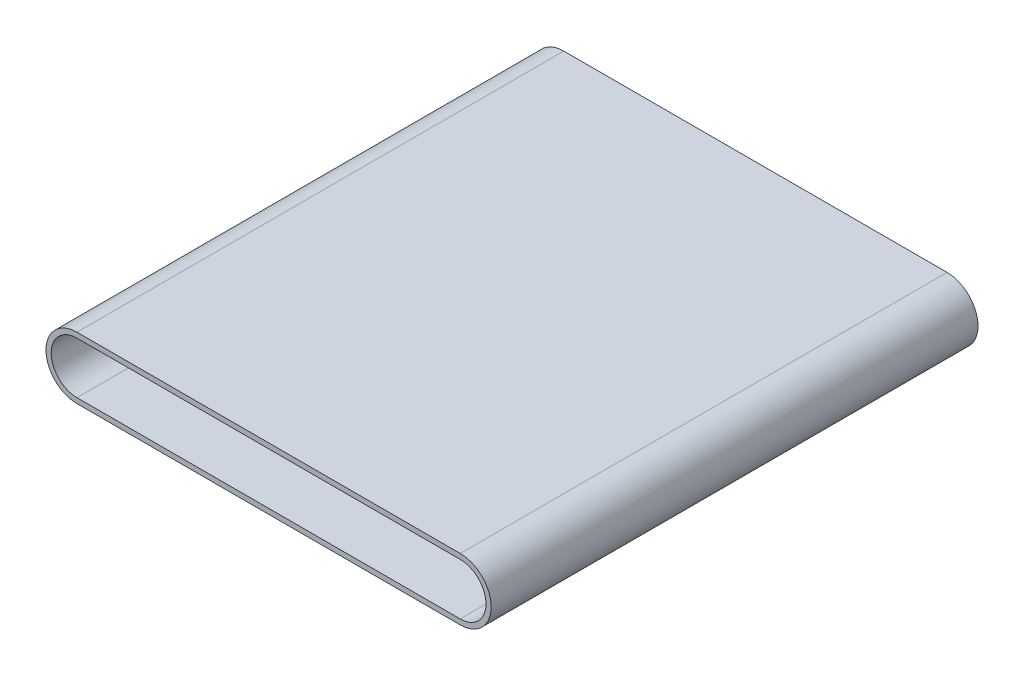
ISO-10303-21;
HEADER;
FILE_DESCRIPTION(('STEP AP214'),'2;1');
FILE_NAME('part.step','',(''),(''),'','','');
FILE_SCHEMA(('AUTOMOTIVE_DESIGN { 1 0 10303 214 1 1 1 1 }'));
ENDSEC;
DATA;
#1=APPLICATION_CONTEXT('core data for automotive mechanical design processes');
#2=APPLICATION_PROTOCOL_DEFINITION('international standard','automotive_design',2000,#1);
#3=PRODUCT_CONTEXT('',#1,'mechanical');
#4=PRODUCT('Part','Part','',(#3));
#5=PRODUCT_RELATED_PRODUCT_CATEGORY('part','',(#4));
#6=PRODUCT_DEFINITION_FORMATION('','',#4);
#7=PRODUCT_DEFINITION_CONTEXT('part definition',#1,'design');
#8=PRODUCT_DEFINITION('design','',#6,#7);
#9=PRODUCT_DEFINITION_SHAPE('','',#8);
#10=(LENGTH_UNIT() NAMED_UNIT(*) SI_UNIT(.MILLI.,.METRE.));
#11=(NAMED_UNIT(*) PLANE_ANGLE_UNIT() SI_UNIT($,.RADIAN.));
#12=(NAMED_UNIT(*) SI_UNIT($,.STERADIAN.) SOLID_ANGLE_UNIT());
#13=UNCERTAINTY_MEASURE_WITH_UNIT(LENGTH_MEASURE(1.E-05),#10,'distance_accuracy_value','');
#14=(GEOMETRIC_REPRESENTATION_CONTEXT(3) GLOBAL_UNCERTAINTY_ASSIGNED_CONTEXT((#13)) GLOBAL_UNIT_ASSIGNED_CONTEXT((#10,
#11,#12)) REPRESENTATION_CONTEXT('',''));
#15=CARTESIAN_POINT('',(0.,0.,0.));
#16=DIRECTION('',(0.,0.,1.));
#17=DIRECTION('',(1.,0.,0.));
#18=AXIS2_PLACEMENT_3D('',#15,#16,#17);
#19=CARTESIAN_POINT('',(-370.,24.8750000000001,235.));
#20=DIRECTION('',(0.,-1.,0.));
#21=DIRECTION('',(0.,0.,-1.));
#22=AXIS2_PLACEMENT_3D('',#19,#20,#21);
#23=PLANE('',#22);
#24=DIRECTION('',(0.,0.,-1.));
#25=VECTOR('',#24,1.);
#26=CARTESIAN_POINT('',(-370.,24.8750000000001,235.));
#27=LINE('',#26,#25);
#28=CARTESIAN_POINT('',(-370.,24.8750000000001,235.));
#29=VERTEX_POINT('',#28);
#30=CARTESIAN_POINT('',(-370.,24.8750000000001,-235.));
#31=VERTEX_POINT('',#30);
#32=EDGE_CURVE('E124',#29,#31,#27,.T.);
#33=ORIENTED_EDGE('',*,*,#32,.T.);
#34=DIRECTION('',(1.,0.,0.));
#35=VECTOR('',#34,1.);
#36=CARTESIAN_POINT('',(-370.,24.8750000000001,-235.));
#37=LINE('',#36,#35);
#38=CARTESIAN_POINT('',(0.,24.8750000000001,-235.));
#39=VERTEX_POINT('',#38);
#40=EDGE_CURVE('E46',#31,#39,#37,.T.);
#41=ORIENTED_EDGE('',*,*,#40,.T.);
#42=CARTESIAN_POINT('',(0.,24.8750000000001,235.));
#43=DIRECTION('',(0.,0.,-1.));
#44=VECTOR('',#43,1.);
#45=LINE('',#42,#44);
#46=CARTESIAN_POINT('',(0.,24.8750000000001,235.));
#47=VERTEX_POINT('',#46);
#48=EDGE_CURVE('E115',#47,#39,#45,.T.);
#49=ORIENTED_EDGE('',*,*,#48,.F.);
#50=DIRECTION('',(1.,0.,0.));
#51=VECTOR('',#50,1.);
#52=CARTESIAN_POINT('',(-370.,24.8750000000001,235.));
#53=LINE('',#52,#51);
#54=EDGE_CURVE('E11',#29,#47,#53,.T.);
#55=ORIENTED_EDGE('',*,*,#54,.F.);
#56=EDGE_LOOP('',(#33,#41,#49,#55));
#57=FACE_BOUND('',#56,.T.);
#58=ADVANCED_FACE('F35',(#57),#23,.T.);
#59=CARTESIAN_POINT('',(-370.,29.8750000000001,235.));
#60=DIRECTION('',(0.,1.,0.));
#61=DIRECTION('',(0.,0.,1.));
#62=AXIS2_PLACEMENT_3D('',#59,#60,#61);
#63=PLANE('',#62);
#64=DIRECTION('',(0.,0.,1.));
#65=VECTOR('',#64,1.);
#66=CARTESIAN_POINT('',(-370.,29.8750000000001,235.));
#67=LINE('',#66,#65);
#68=CARTESIAN_POINT('',(-370.,29.8750000000001,-235.));
#69=VERTEX_POINT('',#68);
#70=CARTESIAN_POINT('',(-370.,29.8750000000001,235.));
#71=VERTEX_POINT('',#70);
#72=EDGE_CURVE('E216',#69,#71,#67,.T.);
#73=ORIENTED_EDGE('',*,*,#72,.T.);
#74=DIRECTION('',(1.,0.,0.));
#75=VECTOR('',#74,1.);
#76=CARTESIAN_POINT('',(-370.,29.8750000000001,235.));
#77=LINE('',#76,#75);
#78=CARTESIAN_POINT('',(0.,29.8750000000001,235.));
#79=VERTEX_POINT('',#78);
#80=EDGE_CURVE('E62',#71,#79,#77,.T.);
#81=ORIENTED_EDGE('',*,*,#80,.T.);
#82=CARTESIAN_POINT('',(0.,29.8750000000001,-235.));
#83=DIRECTION('',(0.,0.,1.));
#84=VECTOR('',#83,1.);
#85=LINE('',#82,#84);
#86=CARTESIAN_POINT('',(0.,29.8750000000001,-235.));
#87=VERTEX_POINT('',#86);
#88=EDGE_CURVE('E120',#87,#79,#85,.T.);
#89=ORIENTED_EDGE('',*,*,#88,.F.);
#90=DIRECTION('',(1.,0.,0.));
#91=VECTOR('',#90,1.);
#92=CARTESIAN_POINT('',(-370.,29.8750000000001,-235.));
#93=LINE('',#92,#91);
#94=EDGE_CURVE('E126',#69,#87,#93,.T.);
#95=ORIENTED_EDGE('',*,*,#94,.F.);
#96=EDGE_LOOP('',(#73,#81,#89,#95));
#97=FACE_BOUND('',#96,.T.);
#98=ADVANCED_FACE('F144',(#97),#63,.T.);
#99=CARTESIAN_POINT('',(-370.,0.,0.));
#100=DIRECTION('',(0.,0.,-1.));
#101=DIRECTION('',(-1.,0.,0.));
#102=AXIS2_PLACEMENT_3D('',#99,#100,#101);
#103=CYLINDRICAL_SURFACE('',#102,24.8750000000001);
#104=DIRECTION('',(0.,0.,-1.));
#105=VECTOR('',#104,1.);
#106=CARTESIAN_POINT('',(-370.,-24.8750000000001,235.));
#107=LINE('',#106,#105);
#108=CARTESIAN_POINT('',(-370.,-24.8750000000001,235.));
#109=VERTEX_POINT('',#108);
#110=CARTESIAN_POINT('',(-370.,-24.8750000000001,-235.));
#111=VERTEX_POINT('',#110);
#112=EDGE_CURVE('E227',#109,#111,#107,.T.);
#113=ORIENTED_EDGE('',*,*,#112,.T.);
#114=CARTESIAN_POINT('',(-370.,0.,-235.));
#115=DIRECTION('',(0.,0.,-1.));
#116=DIRECTION('',(-1.,0.,0.));
#117=AXIS2_PLACEMENT_3D('',#114,#115,#116);
#118=CIRCLE('',#117,24.8750000000001);
#119=EDGE_CURVE('E198',#111,#31,#118,.T.);
#120=ORIENTED_EDGE('',*,*,#119,.T.);
#121=ORIENTED_EDGE('',*,*,#32,.F.);
#122=CARTESIAN_POINT('',(-370.,0.,235.));
#123=DIRECTION('',(0.,0.,-1.));
#124=DIRECTION('',(-1.,0.,0.));
#125=AXIS2_PLACEMENT_3D('',#122,#123,#124);
#126=CIRCLE('',#125,24.8750000000001);
#127=EDGE_CURVE('E196',#109,#29,#126,.T.);
#128=ORIENTED_EDGE('',*,*,#127,.F.);
#129=EDGE_LOOP('',(#113,#120,#121,#128));
#130=FACE_BOUND('',#129,.T.);
#131=ADVANCED_FACE('F153',(#130),#103,.F.);
#132=CARTESIAN_POINT('',(-370.,0.,0.));
#133=DIRECTION('',(0.,0.,-1.));
#134=DIRECTION('',(-1.,0.,0.));
#135=AXIS2_PLACEMENT_3D('',#132,#133,#134);
#136=CYLINDRICAL_SURFACE('',#135,29.8750000000001);
#137=DIRECTION('',(0.,0.,1.));
#138=VECTOR('',#137,1.);
#139=CARTESIAN_POINT('',(-370.,-29.8750000000001,235.));
#140=LINE('',#139,#138);
#141=CARTESIAN_POINT('',(-370.,-29.8750000000001,-235.));
#142=VERTEX_POINT('',#141);
#143=CARTESIAN_POINT('',(-370.,-29.8750000000001,235.));
#144=VERTEX_POINT('',#143);
#145=EDGE_CURVE('E230',#142,#144,#140,.T.);
#146=ORIENTED_EDGE('',*,*,#145,.T.);
#147=CARTESIAN_POINT('',(-370.,0.,235.));
#148=DIRECTION('',(0.,0.,-1.));
#149=DIRECTION('',(-1.,0.,0.));
#150=AXIS2_PLACEMENT_3D('',#147,#148,#149);
#151=CIRCLE('',#150,29.8750000000001);
#152=EDGE_CURVE('E212',#144,#71,#151,.T.);
#153=ORIENTED_EDGE('',*,*,#152,.T.);
#154=ORIENTED_EDGE('',*,*,#72,.F.);
#155=CARTESIAN_POINT('',(-370.,0.,-235.));
#156=DIRECTION('',(0.,0.,-1.));
#157=DIRECTION('',(-1.,0.,0.));
#158=AXIS2_PLACEMENT_3D('',#155,#156,#157);
#159=CIRCLE('',#158,29.8750000000001);
#160=EDGE_CURVE('E202',#142,#69,#159,.T.);
#161=ORIENTED_EDGE('',*,*,#160,.F.);
#162=EDGE_LOOP('',(#146,#153,#154,#161));
#163=FACE_BOUND('',#162,.T.);
#164=ADVANCED_FACE('F156',(#163),#136,.T.);
#165=CARTESIAN_POINT('',(-2.18998296012152E-13,-24.8750000000001,235.));
#166=DIRECTION('',(0.,1.,0.));
#167=DIRECTION('',(0.,0.,1.));
#168=AXIS2_PLACEMENT_3D('',#165,#166,#167);
#169=PLANE('',#168);
#170=DIRECTION('',(0.,0.,-1.));
#171=VECTOR('',#170,1.);
#172=CARTESIAN_POINT('',(-2.18998296012152E-13,-24.8750000000001,235.));
#173=LINE('',#172,#171);
#174=CARTESIAN_POINT('',(-2.18998296012152E-13,-24.8750000000001,235.));
#175=VERTEX_POINT('',#174);
#176=CARTESIAN_POINT('',(-2.18998296012152E-13,-24.8750000000001,-235.));
#177=VERTEX_POINT('',#176);
#178=EDGE_CURVE('E236',#175,#177,#173,.T.);
#179=ORIENTED_EDGE('',*,*,#178,.T.);
#180=DIRECTION('',(-1.,0.,0.));
#181=VECTOR('',#180,1.);
#182=CARTESIAN_POINT('',(-2.18998296012152E-13,-24.8750000000001,-235.));
#183=LINE('',#182,#181);
#184=EDGE_CURVE('E111',#177,#111,#183,.T.);
#185=ORIENTED_EDGE('',*,*,#184,.T.);
#186=ORIENTED_EDGE('',*,*,#112,.F.);
#187=DIRECTION('',(-1.,0.,0.));
#188=VECTOR('',#187,1.);
#189=CARTESIAN_POINT('',(-2.18998296012152E-13,-24.8750000000001,235.));
#190=LINE('',#189,#188);
#191=EDGE_CURVE('E218',#175,#109,#190,.T.);
#192=ORIENTED_EDGE('',*,*,#191,.F.);
#193=EDGE_LOOP('',(#179,#185,#186,#192));
#194=FACE_BOUND('',#193,.T.);
#195=ADVANCED_FACE('F160',(#194),#169,.T.);
#196=CARTESIAN_POINT('',(-2.18385972612579E-13,-29.8750000000001,235.));
#197=DIRECTION('',(0.,-1.,0.));
#198=DIRECTION('',(0.,0.,-1.));
#199=AXIS2_PLACEMENT_3D('',#196,#197,#198);
#200=PLANE('',#199);
#201=DIRECTION('',(0.,0.,1.));
#202=VECTOR('',#201,1.);
#203=CARTESIAN_POINT('',(-2.18385972612579E-13,-29.8750000000001,235.));
#204=LINE('',#203,#202);
#205=CARTESIAN_POINT('',(-2.18385972612579E-13,-29.8750000000001,-235.));
#206=VERTEX_POINT('',#205);
#207=CARTESIAN_POINT('',(-2.18385972612579E-13,-29.8750000000001,235.));
#208=VERTEX_POINT('',#207);
#209=EDGE_CURVE('E233',#206,#208,#204,.T.);
#210=ORIENTED_EDGE('',*,*,#209,.T.);
#211=DIRECTION('',(-1.,0.,0.));
#212=VECTOR('',#211,1.);
#213=CARTESIAN_POINT('',(-2.18385972612579E-13,-29.8750000000001,235.));
#214=LINE('',#213,#212);
#215=EDGE_CURVE('E224',#208,#144,#214,.T.);
#216=ORIENTED_EDGE('',*,*,#215,.T.);
#217=ORIENTED_EDGE('',*,*,#145,.F.);
#218=DIRECTION('',(-1.,0.,0.));
#219=VECTOR('',#218,1.);
#220=CARTESIAN_POINT('',(-2.18385972612579E-13,-29.8750000000001,-235.));
#221=LINE('',#220,#219);
#222=EDGE_CURVE('E221',#206,#142,#221,.T.);
#223=ORIENTED_EDGE('',*,*,#222,.F.);
#224=EDGE_LOOP('',(#210,#216,#217,#223));
#225=FACE_BOUND('',#224,.T.);
#226=ADVANCED_FACE('F164',(#225),#200,.T.);
#227=CARTESIAN_POINT('',(-2.18998296012152E-13,-24.8750000000001,235.));
#228=DIRECTION('',(0.,0.,-1.));
#229=DIRECTION('',(-1.,0.,0.));
#230=AXIS2_PLACEMENT_3D('',#227,#228,#229);
#231=PLANE('',#230);
#232=CARTESIAN_POINT('',(-1.11022302462516E-13,0.,235.));
#233=DIRECTION('',(0.,0.,1.));
#234=DIRECTION('',(1.,0.,0.));
#235=AXIS2_PLACEMENT_3D('',#232,#233,#234);
#236=CIRCLE('',#235,24.8750000000001);
#237=EDGE_CURVE('E54',#175,#47,#236,.T.);
#238=ORIENTED_EDGE('',*,*,#237,.F.);
#239=ORIENTED_EDGE('',*,*,#191,.T.);
#240=ORIENTED_EDGE('',*,*,#127,.T.);
#241=ORIENTED_EDGE('',*,*,#54,.T.);
#242=EDGE_LOOP('',(#238,#239,#240,#241));
#243=FACE_BOUND('',#242,.T.);
#244=CARTESIAN_POINT('',(-1.11022302462516E-13,0.,235.));
#245=DIRECTION('',(0.,0.,1.));
#246=DIRECTION('',(1.,0.,0.));
#247=AXIS2_PLACEMENT_3D('',#244,#245,#246);
#248=CIRCLE('',#247,29.8750000000001);
#249=EDGE_CURVE('E191',#208,#79,#248,.T.);
#250=ORIENTED_EDGE('',*,*,#249,.T.);
#251=ORIENTED_EDGE('',*,*,#80,.F.);
#252=ORIENTED_EDGE('',*,*,#152,.F.);
#253=ORIENTED_EDGE('',*,*,#215,.F.);
#254=EDGE_LOOP('',(#250,#251,#252,#253));
#255=FACE_BOUND('',#254,.T.);
#256=ADVANCED_FACE('F167',(#243,#255),#231,.F.);
#257=CARTESIAN_POINT('',(-1.11022302462516E-13,0.,0.));
#258=DIRECTION('',(0.,0.,1.));
#259=DIRECTION('',(1.,0.,0.));
#260=AXIS2_PLACEMENT_3D('',#257,#258,#259);
#261=CYLINDRICAL_SURFACE('',#260,29.8750000000001);
#262=CARTESIAN_POINT('',(-1.11022302462516E-13,0.,-235.));
#263=DIRECTION('',(0.,0.,1.));
#264=DIRECTION('',(1.,0.,0.));
#265=AXIS2_PLACEMENT_3D('',#262,#263,#264);
#266=CIRCLE('',#265,29.8750000000001);
#267=EDGE_CURVE('E113',#206,#87,#266,.T.);
#268=ORIENTED_EDGE('',*,*,#267,.T.);
#269=ORIENTED_EDGE('',*,*,#88,.T.);
#270=ORIENTED_EDGE('',*,*,#249,.F.);
#271=ORIENTED_EDGE('',*,*,#209,.F.);
#272=EDGE_LOOP('',(#268,#269,#270,#271));
#273=FACE_BOUND('',#272,.T.);
#274=ADVANCED_FACE('F169',(#273),#261,.T.);
#275=CARTESIAN_POINT('',(-2.18998296012152E-13,-24.8750000000001,-235.));
#276=DIRECTION('',(0.,0.,1.));
#277=DIRECTION('',(1.,0.,0.));
#278=AXIS2_PLACEMENT_3D('',#275,#276,#277);
#279=PLANE('',#278);
#280=ORIENTED_EDGE('',*,*,#267,.F.);
#281=ORIENTED_EDGE('',*,*,#222,.T.);
#282=ORIENTED_EDGE('',*,*,#160,.T.);
#283=ORIENTED_EDGE('',*,*,#94,.T.);
#284=EDGE_LOOP('',(#280,#281,#282,#283));
#285=FACE_BOUND('',#284,.T.);
#286=CARTESIAN_POINT('',(-1.11022302462516E-13,0.,-235.));
#287=DIRECTION('',(0.,0.,1.));
#288=DIRECTION('',(1.,0.,0.));
#289=AXIS2_PLACEMENT_3D('',#286,#287,#288);
#290=CIRCLE('',#289,24.8750000000001);
#291=EDGE_CURVE('E106',#177,#39,#290,.T.);
#292=ORIENTED_EDGE('',*,*,#291,.T.);
#293=ORIENTED_EDGE('',*,*,#40,.F.);
#294=ORIENTED_EDGE('',*,*,#119,.F.);
#295=ORIENTED_EDGE('',*,*,#184,.F.);
#296=EDGE_LOOP('',(#292,#293,#294,#295));
#297=FACE_BOUND('',#296,.T.);
#298=ADVANCED_FACE('F107',(#285,#297),#279,.F.);
#299=CARTESIAN_POINT('',(-1.11022302462516E-13,0.,0.));
#300=DIRECTION('',(0.,0.,1.));
#301=DIRECTION('',(1.,0.,0.));
#302=AXIS2_PLACEMENT_3D('',#299,#300,#301);
#303=CYLINDRICAL_SURFACE('',#302,24.8750000000001);
#304=ORIENTED_EDGE('',*,*,#178,.F.);
#305=ORIENTED_EDGE('',*,*,#237,.T.);
#306=ORIENTED_EDGE('',*,*,#48,.T.);
#307=ORIENTED_EDGE('',*,*,#291,.F.);
#308=EDGE_LOOP('',(#304,#305,#306,#307));
#309=FACE_BOUND('',#308,.T.);
#310=ADVANCED_FACE('F117',(#309),#303,.F.);
#311=CLOSED_SHELL('',(#58,#98,#131,#164,#195,#226,#256,#274,#298,#310));
#312=MANIFOLD_SOLID_BREP('B2',#311);
#313=ADVANCED_BREP_SHAPE_REPRESENTATION('',(#18,#312),#14);
#314=SHAPE_DEFINITION_REPRESENTATION(#9,#313);
ENDSEC;
END-ISO-10303-21;
